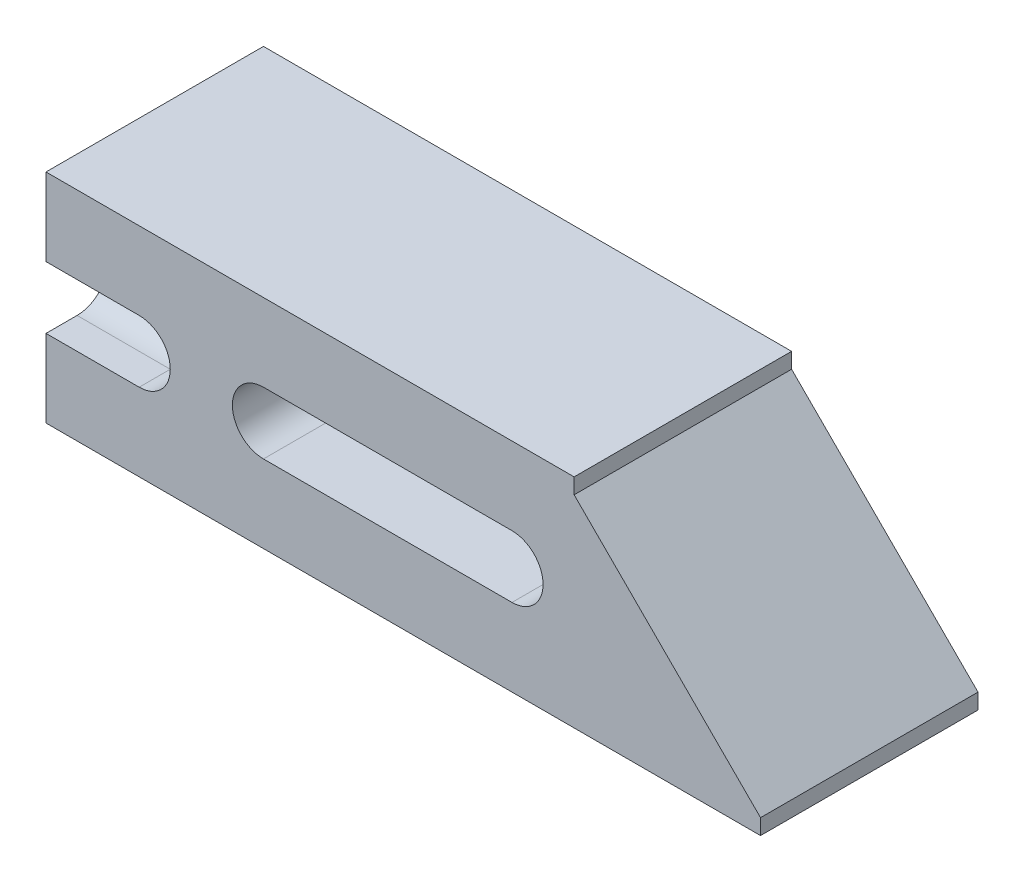
ISO-10303-21;
HEADER;
FILE_DESCRIPTION(('STEP AP214'),'2;1');
FILE_NAME('part.step','',(''),(''),'','','');
FILE_SCHEMA(('AUTOMOTIVE_DESIGN { 1 0 10303 214 1 1 1 1 }'));
ENDSEC;
DATA;
#1=APPLICATION_CONTEXT('core data for automotive mechanical design processes');
#2=APPLICATION_PROTOCOL_DEFINITION('international standard','automotive_design',2000,#1);
#3=PRODUCT_CONTEXT('',#1,'mechanical');
#4=PRODUCT('Part','Part','',(#3));
#5=PRODUCT_RELATED_PRODUCT_CATEGORY('part','',(#4));
#6=PRODUCT_DEFINITION_FORMATION('','',#4);
#7=PRODUCT_DEFINITION_CONTEXT('part definition',#1,'design');
#8=PRODUCT_DEFINITION('design','',#6,#7);
#9=PRODUCT_DEFINITION_SHAPE('','',#8);
#10=(LENGTH_UNIT() NAMED_UNIT(*) SI_UNIT(.MILLI.,.METRE.));
#11=(NAMED_UNIT(*) PLANE_ANGLE_UNIT() SI_UNIT($,.RADIAN.));
#12=(NAMED_UNIT(*) SI_UNIT($,.STERADIAN.) SOLID_ANGLE_UNIT());
#13=UNCERTAINTY_MEASURE_WITH_UNIT(LENGTH_MEASURE(1.E-05),#10,'distance_accuracy_value','');
#14=(GEOMETRIC_REPRESENTATION_CONTEXT(3) GLOBAL_UNCERTAINTY_ASSIGNED_CONTEXT((#13)) GLOBAL_UNIT_ASSIGNED_CONTEXT((#10,
#11,#12)) REPRESENTATION_CONTEXT('',''));
#15=CARTESIAN_POINT('',(0.,0.,0.));
#16=DIRECTION('',(0.,0.,1.));
#17=DIRECTION('',(1.,0.,0.));
#18=AXIS2_PLACEMENT_3D('',#15,#16,#17);
#19=CARTESIAN_POINT('',(9.525,11.1125,-6.98500000000001));
#20=DIRECTION('',(0.,0.,1.));
#21=DIRECTION('',(1.,0.,0.));
#22=AXIS2_PLACEMENT_3D('',#19,#20,#21);
#23=CYLINDRICAL_SURFACE('',#22,3.175);
#24=DIRECTION('',(0.,0.,1.));
#25=VECTOR('',#24,1.);
#26=CARTESIAN_POINT('',(9.525,7.93749999999999,-6.98500000000001));
#27=LINE('',#26,#25);
#28=CARTESIAN_POINT('',(9.525,7.9375,19.05));
#29=VERTEX_POINT('',#28);
#30=CARTESIAN_POINT('',(9.52500000000001,7.9375,22.225));
#31=VERTEX_POINT('',#30);
#32=EDGE_CURVE('E190',#29,#31,#27,.T.);
#33=ORIENTED_EDGE('',*,*,#32,.T.);
#34=CARTESIAN_POINT('',(9.525,11.1125,22.225));
#35=DIRECTION('',(0.,0.,1.));
#36=DIRECTION('',(1.,0.,0.));
#37=AXIS2_PLACEMENT_3D('',#34,#35,#36);
#38=CIRCLE('',#37,3.175);
#39=CARTESIAN_POINT('',(9.525,14.2875,22.225));
#40=VERTEX_POINT('',#39);
#41=EDGE_CURVE('E183',#31,#40,#38,.T.);
#42=ORIENTED_EDGE('',*,*,#41,.T.);
#43=DIRECTION('',(0.,0.,1.));
#44=VECTOR('',#43,1.);
#45=CARTESIAN_POINT('',(9.525,14.2875,-6.98500000000002));
#46=LINE('',#45,#44);
#47=CARTESIAN_POINT('',(9.525,14.2875,19.05));
#48=VERTEX_POINT('',#47);
#49=EDGE_CURVE('E202',#48,#40,#46,.T.);
#50=ORIENTED_EDGE('',*,*,#49,.F.);
#51=CARTESIAN_POINT('',(9.525,11.1125,19.05));
#52=DIRECTION('',(-0.707106781186547,0.,0.707106781186547));
#53=DIRECTION('',(-0.707106781186547,0.,-0.707106781186547));
#54=AXIS2_PLACEMENT_3D('',#51,#52,#53);
#55=ELLIPSE('',#54,4.49012806053458,3.175);
#56=EDGE_CURVE('E199',#29,#48,#55,.F.);
#57=ORIENTED_EDGE('',*,*,#56,.F.);
#58=EDGE_LOOP('',(#33,#42,#50,#57));
#59=FACE_BOUND('',#58,.T.);
#60=DIRECTION('',(0.,0.,1.));
#61=VECTOR('',#60,1.);
#62=CARTESIAN_POINT('',(9.525,7.9375,-6.98500000000001));
#63=LINE('',#62,#61);
#64=CARTESIAN_POINT('',(9.525,7.9375,0.));
#65=VERTEX_POINT('',#64);
#66=CARTESIAN_POINT('',(9.52500000000001,7.9375,3.175));
#67=VERTEX_POINT('',#66);
#68=EDGE_CURVE('E168',#65,#67,#63,.T.);
#69=ORIENTED_EDGE('',*,*,#68,.T.);
#70=CARTESIAN_POINT('',(9.525,11.1125,3.175));
#71=DIRECTION('',(-0.707106781186547,0.,-0.707106781186547));
#72=DIRECTION('',(-0.707106781186547,0.,0.707106781186547));
#73=AXIS2_PLACEMENT_3D('',#70,#71,#72);
#74=ELLIPSE('',#73,4.49012806053458,3.175);
#75=CARTESIAN_POINT('',(9.525,14.2875,3.175));
#76=VERTEX_POINT('',#75);
#77=EDGE_CURVE('E179',#76,#67,#74,.F.);
#78=ORIENTED_EDGE('',*,*,#77,.F.);
#79=DIRECTION('',(0.,0.,1.));
#80=VECTOR('',#79,1.);
#81=CARTESIAN_POINT('',(9.525,14.2875,-6.98500000000001));
#82=LINE('',#81,#80);
#83=CARTESIAN_POINT('',(9.525,14.2875,0.));
#84=VERTEX_POINT('',#83);
#85=EDGE_CURVE('E184',#84,#76,#82,.T.);
#86=ORIENTED_EDGE('',*,*,#85,.F.);
#87=CARTESIAN_POINT('',(9.525,11.1125,0.));
#88=DIRECTION('',(0.,0.,-1.));
#89=DIRECTION('',(-1.,0.,0.));
#90=AXIS2_PLACEMENT_3D('',#87,#88,#89);
#91=CIRCLE('',#90,3.175);
#92=EDGE_CURVE('E188',#84,#65,#91,.T.);
#93=ORIENTED_EDGE('',*,*,#92,.T.);
#94=EDGE_LOOP('',(#69,#78,#86,#93));
#95=FACE_BOUND('',#94,.T.);
#96=ADVANCED_FACE('F39',(#59,#95),#23,.F.);
#97=CARTESIAN_POINT('',(73.025,0.,22.225));
#98=DIRECTION('',(0.,1.,0.));
#99=DIRECTION('',(-1.,0.,0.));
#100=AXIS2_PLACEMENT_3D('',#97,#98,#99);
#101=PLANE('',#100);
#102=DIRECTION('',(1.,0.,0.));
#103=VECTOR('',#102,1.);
#104=CARTESIAN_POINT('',(73.025,0.,0.));
#105=LINE('',#104,#103);
#106=CARTESIAN_POINT('',(0.,0.,0.));
#107=VERTEX_POINT('',#106);
#108=CARTESIAN_POINT('',(73.025,0.,0.));
#109=VERTEX_POINT('',#108);
#110=EDGE_CURVE('E280',#107,#109,#105,.T.);
#111=ORIENTED_EDGE('',*,*,#110,.T.);
#112=DIRECTION('',(0.,0.,-1.));
#113=VECTOR('',#112,1.);
#114=CARTESIAN_POINT('',(73.025,0.,22.225));
#115=LINE('',#114,#113);
#116=CARTESIAN_POINT('',(73.025,0.,22.225));
#117=VERTEX_POINT('',#116);
#118=EDGE_CURVE('E319',#117,#109,#115,.T.);
#119=ORIENTED_EDGE('',*,*,#118,.F.);
#120=DIRECTION('',(1.,0.,0.));
#121=VECTOR('',#120,1.);
#122=CARTESIAN_POINT('',(73.025,0.,22.225));
#123=LINE('',#122,#121);
#124=CARTESIAN_POINT('',(0.,0.,22.225));
#125=VERTEX_POINT('',#124);
#126=EDGE_CURVE('E257',#125,#117,#123,.T.);
#127=ORIENTED_EDGE('',*,*,#126,.F.);
#128=DIRECTION('',(0.,0.,-1.));
#129=VECTOR('',#128,1.);
#130=CARTESIAN_POINT('',(0.,0.,22.225));
#131=LINE('',#130,#129);
#132=EDGE_CURVE('E279',#125,#107,#131,.T.);
#133=ORIENTED_EDGE('',*,*,#132,.T.);
#134=EDGE_LOOP('',(#111,#119,#127,#133));
#135=FACE_BOUND('',#134,.T.);
#136=ADVANCED_FACE('F41',(#135),#101,.F.);
#137=CARTESIAN_POINT('',(73.025,1.5875,22.225));
#138=DIRECTION('',(-1.,0.,0.));
#139=DIRECTION('',(0.,0.,1.));
#140=AXIS2_PLACEMENT_3D('',#137,#138,#139);
#141=PLANE('',#140);
#142=DIRECTION('',(0.,1.,0.));
#143=VECTOR('',#142,1.);
#144=CARTESIAN_POINT('',(73.025,1.5875,0.));
#145=LINE('',#144,#143);
#146=CARTESIAN_POINT('',(73.025,1.5875,0.));
#147=VERTEX_POINT('',#146);
#148=EDGE_CURVE('E284',#109,#147,#145,.T.);
#149=ORIENTED_EDGE('',*,*,#148,.T.);
#150=DIRECTION('',(0.,0.,-1.));
#151=VECTOR('',#150,1.);
#152=CARTESIAN_POINT('',(73.025,1.5875,22.225));
#153=LINE('',#152,#151);
#154=CARTESIAN_POINT('',(73.025,1.5875,22.225));
#155=VERTEX_POINT('',#154);
#156=EDGE_CURVE('E315',#155,#147,#153,.T.);
#157=ORIENTED_EDGE('',*,*,#156,.F.);
#158=DIRECTION('',(0.,1.,0.));
#159=VECTOR('',#158,1.);
#160=CARTESIAN_POINT('',(73.025,1.5875,22.225));
#161=LINE('',#160,#159);
#162=EDGE_CURVE('E261',#117,#155,#161,.T.);
#163=ORIENTED_EDGE('',*,*,#162,.F.);
#164=ORIENTED_EDGE('',*,*,#118,.T.);
#165=EDGE_LOOP('',(#149,#157,#163,#164));
#166=FACE_BOUND('',#165,.T.);
#167=ADVANCED_FACE('F374',(#166),#141,.F.);
#168=CARTESIAN_POINT('',(53.975,20.6374999999998,22.225));
#169=DIRECTION('',(-0.707106781186543,-0.707106781186552,0.));
#170=DIRECTION('',(0.707106781186552,-0.707106781186543,0.));
#171=AXIS2_PLACEMENT_3D('',#168,#169,#170);
#172=PLANE('',#171);
#173=DIRECTION('',(-0.707106781186552,0.707106781186543,0.));
#174=VECTOR('',#173,1.);
#175=CARTESIAN_POINT('',(53.975,20.6374999999998,0.));
#176=LINE('',#175,#174);
#177=CARTESIAN_POINT('',(53.975,20.6374999999998,0.));
#178=VERTEX_POINT('',#177);
#179=EDGE_CURVE('E287',#147,#178,#176,.T.);
#180=ORIENTED_EDGE('',*,*,#179,.T.);
#181=DIRECTION('',(0.,0.,-1.));
#182=VECTOR('',#181,1.);
#183=CARTESIAN_POINT('',(53.975,20.6374999999998,22.225));
#184=LINE('',#183,#182);
#185=CARTESIAN_POINT('',(53.975,20.6374999999998,22.225));
#186=VERTEX_POINT('',#185);
#187=EDGE_CURVE('E311',#186,#178,#184,.T.);
#188=ORIENTED_EDGE('',*,*,#187,.F.);
#189=DIRECTION('',(-0.707106781186552,0.707106781186543,0.));
#190=VECTOR('',#189,1.);
#191=CARTESIAN_POINT('',(53.975,20.6374999999998,22.225));
#192=LINE('',#191,#190);
#193=EDGE_CURVE('E265',#155,#186,#192,.T.);
#194=ORIENTED_EDGE('',*,*,#193,.F.);
#195=ORIENTED_EDGE('',*,*,#156,.T.);
#196=EDGE_LOOP('',(#180,#188,#194,#195));
#197=FACE_BOUND('',#196,.T.);
#198=ADVANCED_FACE('F393',(#197),#172,.F.);
#199=CARTESIAN_POINT('',(53.975,22.225,22.225));
#200=DIRECTION('',(-1.,0.,0.));
#201=DIRECTION('',(0.,0.,1.));
#202=AXIS2_PLACEMENT_3D('',#199,#200,#201);
#203=PLANE('',#202);
#204=DIRECTION('',(0.,1.,0.));
#205=VECTOR('',#204,1.);
#206=CARTESIAN_POINT('',(53.975,22.225,0.));
#207=LINE('',#206,#205);
#208=CARTESIAN_POINT('',(53.975,22.225,0.));
#209=VERTEX_POINT('',#208);
#210=EDGE_CURVE('E290',#178,#209,#207,.T.);
#211=ORIENTED_EDGE('',*,*,#210,.T.);
#212=DIRECTION('',(0.,0.,-1.));
#213=VECTOR('',#212,1.);
#214=CARTESIAN_POINT('',(53.975,22.225,22.225));
#215=LINE('',#214,#213);
#216=CARTESIAN_POINT('',(53.975,22.225,22.225));
#217=VERTEX_POINT('',#216);
#218=EDGE_CURVE('E307',#217,#209,#215,.T.);
#219=ORIENTED_EDGE('',*,*,#218,.F.);
#220=DIRECTION('',(0.,1.,0.));
#221=VECTOR('',#220,1.);
#222=CARTESIAN_POINT('',(53.975,22.225,22.225));
#223=LINE('',#222,#221);
#224=EDGE_CURVE('E268',#186,#217,#223,.T.);
#225=ORIENTED_EDGE('',*,*,#224,.F.);
#226=ORIENTED_EDGE('',*,*,#187,.T.);
#227=EDGE_LOOP('',(#211,#219,#225,#226));
#228=FACE_BOUND('',#227,.T.);
#229=ADVANCED_FACE('F389',(#228),#203,.F.);
#230=CARTESIAN_POINT('',(0.,22.225,22.225));
#231=DIRECTION('',(0.,-1.,0.));
#232=DIRECTION('',(0.,0.,-1.));
#233=AXIS2_PLACEMENT_3D('',#230,#231,#232);
#234=PLANE('',#233);
#235=DIRECTION('',(-1.,0.,0.));
#236=VECTOR('',#235,1.);
#237=CARTESIAN_POINT('',(0.,22.225,0.));
#238=LINE('',#237,#236);
#239=CARTESIAN_POINT('',(0.,22.225,0.));
#240=VERTEX_POINT('',#239);
#241=EDGE_CURVE('E293',#209,#240,#238,.T.);
#242=ORIENTED_EDGE('',*,*,#241,.T.);
#243=DIRECTION('',(0.,0.,-1.));
#244=VECTOR('',#243,1.);
#245=CARTESIAN_POINT('',(0.,22.225,22.225));
#246=LINE('',#245,#244);
#247=CARTESIAN_POINT('',(0.,22.225,22.225));
#248=VERTEX_POINT('',#247);
#249=EDGE_CURVE('E303',#248,#240,#246,.T.);
#250=ORIENTED_EDGE('',*,*,#249,.F.);
#251=DIRECTION('',(-1.,0.,0.));
#252=VECTOR('',#251,1.);
#253=CARTESIAN_POINT('',(0.,22.225,22.225));
#254=LINE('',#253,#252);
#255=EDGE_CURVE('E271',#217,#248,#254,.T.);
#256=ORIENTED_EDGE('',*,*,#255,.F.);
#257=ORIENTED_EDGE('',*,*,#218,.T.);
#258=EDGE_LOOP('',(#242,#250,#256,#257));
#259=FACE_BOUND('',#258,.T.);
#260=ADVANCED_FACE('F385',(#259),#234,.F.);
#261=CARTESIAN_POINT('',(0.,0.,22.225));
#262=DIRECTION('',(1.,0.,0.));
#263=DIRECTION('',(0.,0.,-1.));
#264=AXIS2_PLACEMENT_3D('',#261,#262,#263);
#265=PLANE('',#264);
#266=CARTESIAN_POINT('',(0.,11.1125,3.175));
#267=DIRECTION('',(-1.,0.,0.));
#268=DIRECTION('',(0.,0.,1.));
#269=AXIS2_PLACEMENT_3D('',#266,#267,#268);
#270=CIRCLE('',#269,3.175);
#271=CARTESIAN_POINT('',(0.,7.9375,3.175));
#272=VERTEX_POINT('',#271);
#273=CARTESIAN_POINT('',(0.,14.2875,3.175));
#274=VERTEX_POINT('',#273);
#275=EDGE_CURVE('E429',#272,#274,#270,.T.);
#276=ORIENTED_EDGE('',*,*,#275,.F.);
#277=DIRECTION('',(0.,0.,1.));
#278=VECTOR('',#277,1.);
#279=CARTESIAN_POINT('',(0.,7.9375,0.));
#280=LINE('',#279,#278);
#281=CARTESIAN_POINT('',(0.,7.9375,0.));
#282=VERTEX_POINT('',#281);
#283=EDGE_CURVE('E171',#282,#272,#280,.T.);
#284=ORIENTED_EDGE('',*,*,#283,.F.);
#285=DIRECTION('',(0.,-1.,0.));
#286=VECTOR('',#285,1.);
#287=CARTESIAN_POINT('',(0.,0.,0.));
#288=LINE('',#287,#286);
#289=EDGE_CURVE('E296',#282,#107,#288,.T.);
#290=ORIENTED_EDGE('',*,*,#289,.T.);
#291=ORIENTED_EDGE('',*,*,#132,.F.);
#292=DIRECTION('',(0.,-1.,0.));
#293=VECTOR('',#292,1.);
#294=CARTESIAN_POINT('',(0.,0.,22.225));
#295=LINE('',#294,#293);
#296=CARTESIAN_POINT('',(0.,7.9375,22.225));
#297=VERTEX_POINT('',#296);
#298=EDGE_CURVE('E274',#297,#125,#295,.T.);
#299=ORIENTED_EDGE('',*,*,#298,.F.);
#300=DIRECTION('',(0.,0.,1.));
#301=VECTOR('',#300,1.);
#302=CARTESIAN_POINT('',(0.,7.9375,19.05));
#303=LINE('',#302,#301);
#304=CARTESIAN_POINT('',(0.,7.9375,19.05));
#305=VERTEX_POINT('',#304);
#306=EDGE_CURVE('E208',#305,#297,#303,.T.);
#307=ORIENTED_EDGE('',*,*,#306,.F.);
#308=CARTESIAN_POINT('',(0.,11.1125,19.05));
#309=DIRECTION('',(-1.,0.,0.));
#310=DIRECTION('',(0.,0.,1.));
#311=AXIS2_PLACEMENT_3D('',#308,#309,#310);
#312=CIRCLE('',#311,3.175);
#313=CARTESIAN_POINT('',(0.,14.2875,19.05));
#314=VERTEX_POINT('',#313);
#315=EDGE_CURVE('E205',#314,#305,#312,.T.);
#316=ORIENTED_EDGE('',*,*,#315,.F.);
#317=DIRECTION('',(0.,0.,-1.));
#318=VECTOR('',#317,1.);
#319=CARTESIAN_POINT('',(0.,14.2875,22.225));
#320=LINE('',#319,#318);
#321=CARTESIAN_POINT('',(0.,14.2875,22.225));
#322=VERTEX_POINT('',#321);
#323=EDGE_CURVE('E211',#322,#314,#320,.T.);
#324=ORIENTED_EDGE('',*,*,#323,.F.);
#325=EDGE_CURVE('E275',#248,#322,#295,.T.);
#326=ORIENTED_EDGE('',*,*,#325,.F.);
#327=ORIENTED_EDGE('',*,*,#249,.T.);
#328=CARTESIAN_POINT('',(0.,14.2875,0.));
#329=VERTEX_POINT('',#328);
#330=EDGE_CURVE('E262',#240,#329,#288,.T.);
#331=ORIENTED_EDGE('',*,*,#330,.T.);
#332=DIRECTION('',(0.,0.,-1.));
#333=VECTOR('',#332,1.);
#334=CARTESIAN_POINT('',(0.,14.2875,3.175));
#335=LINE('',#334,#333);
#336=EDGE_CURVE('E426',#274,#329,#335,.T.);
#337=ORIENTED_EDGE('',*,*,#336,.F.);
#338=EDGE_LOOP('',(#276,#284,#290,#291,#299,#307,#316,#324,#326,#327,#331,#337));
#339=FACE_BOUND('',#338,.T.);
#340=ADVANCED_FACE('F379',(#339),#265,.F.);
#341=CARTESIAN_POINT('',(0.,0.,22.225));
#342=DIRECTION('',(0.,0.,-1.));
#343=DIRECTION('',(-1.,0.,0.));
#344=AXIS2_PLACEMENT_3D('',#341,#342,#343);
#345=PLANE('',#344);
#346=DIRECTION('',(-1.,0.,0.));
#347=VECTOR('',#346,1.);
#348=CARTESIAN_POINT('',(47.625,7.9375,22.225));
#349=LINE('',#348,#347);
#350=CARTESIAN_POINT('',(47.625,7.9375,22.225));
#351=VERTEX_POINT('',#350);
#352=CARTESIAN_POINT('',(22.225,7.9375,22.225));
#353=VERTEX_POINT('',#352);
#354=EDGE_CURVE('E229',#351,#353,#349,.T.);
#355=ORIENTED_EDGE('',*,*,#354,.T.);
#356=CARTESIAN_POINT('',(22.225,11.1125,22.225));
#357=DIRECTION('',(0.,0.,1.));
#358=DIRECTION('',(1.,0.,0.));
#359=AXIS2_PLACEMENT_3D('',#356,#357,#358);
#360=CIRCLE('',#359,3.175);
#361=CARTESIAN_POINT('',(22.225,14.2875,22.225));
#362=VERTEX_POINT('',#361);
#363=EDGE_CURVE('E226',#362,#353,#360,.T.);
#364=ORIENTED_EDGE('',*,*,#363,.F.);
#365=DIRECTION('',(1.,0.,0.));
#366=VECTOR('',#365,1.);
#367=CARTESIAN_POINT('',(22.225,14.2875,22.225));
#368=LINE('',#367,#366);
#369=CARTESIAN_POINT('',(47.625,14.2875,22.225));
#370=VERTEX_POINT('',#369);
#371=EDGE_CURVE('E237',#362,#370,#368,.T.);
#372=ORIENTED_EDGE('',*,*,#371,.T.);
#373=CARTESIAN_POINT('',(47.625,11.1125,22.225));
#374=DIRECTION('',(0.,0.,1.));
#375=DIRECTION('',(1.,0.,0.));
#376=AXIS2_PLACEMENT_3D('',#373,#374,#375);
#377=CIRCLE('',#376,3.175);
#378=EDGE_CURVE('E233',#351,#370,#377,.T.);
#379=ORIENTED_EDGE('',*,*,#378,.F.);
#380=EDGE_LOOP('',(#355,#364,#372,#379));
#381=FACE_BOUND('',#380,.T.);
#382=ORIENTED_EDGE('',*,*,#41,.F.);
#383=DIRECTION('',(-1.,0.,0.));
#384=VECTOR('',#383,1.);
#385=CARTESIAN_POINT('',(73.026,7.9375,22.225));
#386=LINE('',#385,#384);
#387=EDGE_CURVE('E220',#31,#297,#386,.T.);
#388=ORIENTED_EDGE('',*,*,#387,.T.);
#389=ORIENTED_EDGE('',*,*,#298,.T.);
#390=ORIENTED_EDGE('',*,*,#126,.T.);
#391=ORIENTED_EDGE('',*,*,#162,.T.);
#392=ORIENTED_EDGE('',*,*,#193,.T.);
#393=ORIENTED_EDGE('',*,*,#224,.T.);
#394=ORIENTED_EDGE('',*,*,#255,.T.);
#395=ORIENTED_EDGE('',*,*,#325,.T.);
#396=DIRECTION('',(-1.,0.,0.));
#397=VECTOR('',#396,1.);
#398=CARTESIAN_POINT('',(73.026,14.2875,22.225));
#399=LINE('',#398,#397);
#400=EDGE_CURVE('E217',#40,#322,#399,.T.);
#401=ORIENTED_EDGE('',*,*,#400,.F.);
#402=EDGE_LOOP('',(#382,#388,#389,#390,#391,#392,#393,#394,#395,#401));
#403=FACE_BOUND('',#402,.T.);
#404=ADVANCED_FACE('F349',(#381,#403),#345,.F.);
#405=CARTESIAN_POINT('',(0.,0.,0.));
#406=DIRECTION('',(0.,0.,-1.));
#407=DIRECTION('',(-1.,0.,0.));
#408=AXIS2_PLACEMENT_3D('',#405,#406,#407);
#409=PLANE('',#408);
#410=DIRECTION('',(-1.,0.,0.));
#411=VECTOR('',#410,1.);
#412=CARTESIAN_POINT('',(73.026,7.9375,0.));
#413=LINE('',#412,#411);
#414=EDGE_CURVE('E421',#65,#282,#413,.T.);
#415=ORIENTED_EDGE('',*,*,#414,.F.);
#416=ORIENTED_EDGE('',*,*,#92,.F.);
#417=DIRECTION('',(-1.,0.,0.));
#418=VECTOR('',#417,1.);
#419=CARTESIAN_POINT('',(73.026,14.2875,0.));
#420=LINE('',#419,#418);
#421=EDGE_CURVE('E63',#84,#329,#420,.T.);
#422=ORIENTED_EDGE('',*,*,#421,.T.);
#423=ORIENTED_EDGE('',*,*,#330,.F.);
#424=ORIENTED_EDGE('',*,*,#241,.F.);
#425=ORIENTED_EDGE('',*,*,#210,.F.);
#426=ORIENTED_EDGE('',*,*,#179,.F.);
#427=ORIENTED_EDGE('',*,*,#148,.F.);
#428=ORIENTED_EDGE('',*,*,#110,.F.);
#429=ORIENTED_EDGE('',*,*,#289,.F.);
#430=EDGE_LOOP('',(#415,#416,#422,#423,#424,#425,#426,#427,#428,#429));
#431=FACE_BOUND('',#430,.T.);
#432=CARTESIAN_POINT('',(22.225,11.1125,0.));
#433=DIRECTION('',(0.,0.,-1.));
#434=DIRECTION('',(-1.,0.,0.));
#435=AXIS2_PLACEMENT_3D('',#432,#433,#434);
#436=CIRCLE('',#435,3.175);
#437=CARTESIAN_POINT('',(22.225,7.9375,0.));
#438=VERTEX_POINT('',#437);
#439=CARTESIAN_POINT('',(22.225,14.2875,0.));
#440=VERTEX_POINT('',#439);
#441=EDGE_CURVE('E11',#438,#440,#436,.T.);
#442=ORIENTED_EDGE('',*,*,#441,.F.);
#443=DIRECTION('',(1.,0.,0.));
#444=VECTOR('',#443,1.);
#445=CARTESIAN_POINT('',(0.,7.9375,0.));
#446=LINE('',#445,#444);
#447=CARTESIAN_POINT('',(47.625,7.9375,0.));
#448=VERTEX_POINT('',#447);
#449=EDGE_CURVE('E323',#438,#448,#446,.T.);
#450=ORIENTED_EDGE('',*,*,#449,.T.);
#451=CARTESIAN_POINT('',(47.625,11.1125,0.));
#452=DIRECTION('',(0.,0.,-1.));
#453=DIRECTION('',(-1.,0.,0.));
#454=AXIS2_PLACEMENT_3D('',#451,#452,#453);
#455=CIRCLE('',#454,3.175);
#456=CARTESIAN_POINT('',(47.625,14.2875,0.));
#457=VERTEX_POINT('',#456);
#458=EDGE_CURVE('E329',#457,#448,#455,.T.);
#459=ORIENTED_EDGE('',*,*,#458,.F.);
#460=DIRECTION('',(-1.,0.,0.));
#461=VECTOR('',#460,1.);
#462=CARTESIAN_POINT('',(0.,14.2875,0.));
#463=LINE('',#462,#461);
#464=EDGE_CURVE('E48',#457,#440,#463,.T.);
#465=ORIENTED_EDGE('',*,*,#464,.T.);
#466=EDGE_LOOP('',(#442,#450,#459,#465));
#467=FACE_BOUND('',#466,.T.);
#468=ADVANCED_FACE('F337',(#431,#467),#409,.T.);
#469=CARTESIAN_POINT('',(22.225,11.1125,-6.98500000000001));
#470=DIRECTION('',(0.,0.,1.));
#471=DIRECTION('',(1.,0.,0.));
#472=AXIS2_PLACEMENT_3D('',#469,#470,#471);
#473=CYLINDRICAL_SURFACE('',#472,3.175);
#474=ORIENTED_EDGE('',*,*,#441,.T.);
#475=DIRECTION('',(0.,0.,1.));
#476=VECTOR('',#475,1.);
#477=CARTESIAN_POINT('',(22.225,14.2875,-6.98500000000001));
#478=LINE('',#477,#476);
#479=EDGE_CURVE('E242',#440,#362,#478,.T.);
#480=ORIENTED_EDGE('',*,*,#479,.T.);
#481=ORIENTED_EDGE('',*,*,#363,.T.);
#482=DIRECTION('',(0.,0.,1.));
#483=VECTOR('',#482,1.);
#484=CARTESIAN_POINT('',(22.225,7.9375,-6.98500000000001));
#485=LINE('',#484,#483);
#486=EDGE_CURVE('E241',#438,#353,#485,.T.);
#487=ORIENTED_EDGE('',*,*,#486,.F.);
#488=EDGE_LOOP('',(#474,#480,#481,#487));
#489=FACE_BOUND('',#488,.T.);
#490=ADVANCED_FACE('F353',(#489),#473,.F.);
#491=CARTESIAN_POINT('',(22.225,14.2875,-6.98500000000001));
#492=DIRECTION('',(0.,-1.,0.));
#493=DIRECTION('',(0.,0.,-1.));
#494=AXIS2_PLACEMENT_3D('',#491,#492,#493);
#495=PLANE('',#494);
#496=DIRECTION('',(0.,0.,1.));
#497=VECTOR('',#496,1.);
#498=CARTESIAN_POINT('',(47.625,14.2875,-6.98500000000001));
#499=LINE('',#498,#497);
#500=EDGE_CURVE('E245',#457,#370,#499,.T.);
#501=ORIENTED_EDGE('',*,*,#500,.T.);
#502=ORIENTED_EDGE('',*,*,#371,.F.);
#503=ORIENTED_EDGE('',*,*,#479,.F.);
#504=ORIENTED_EDGE('',*,*,#464,.F.);
#505=EDGE_LOOP('',(#501,#502,#503,#504));
#506=FACE_BOUND('',#505,.T.);
#507=ADVANCED_FACE('F341',(#506),#495,.T.);
#508=CARTESIAN_POINT('',(47.625,11.1125,-6.98500000000001));
#509=DIRECTION('',(0.,0.,1.));
#510=DIRECTION('',(1.,0.,0.));
#511=AXIS2_PLACEMENT_3D('',#508,#509,#510);
#512=CYLINDRICAL_SURFACE('',#511,3.175);
#513=ORIENTED_EDGE('',*,*,#458,.T.);
#514=DIRECTION('',(0.,0.,1.));
#515=VECTOR('',#514,1.);
#516=CARTESIAN_POINT('',(47.625,7.9375,-6.98500000000001));
#517=LINE('',#516,#515);
#518=EDGE_CURVE('E248',#448,#351,#517,.T.);
#519=ORIENTED_EDGE('',*,*,#518,.T.);
#520=ORIENTED_EDGE('',*,*,#378,.T.);
#521=ORIENTED_EDGE('',*,*,#500,.F.);
#522=EDGE_LOOP('',(#513,#519,#520,#521));
#523=FACE_BOUND('',#522,.T.);
#524=ADVANCED_FACE('F344',(#523),#512,.F.);
#525=CARTESIAN_POINT('',(47.625,7.9375,-6.98500000000001));
#526=DIRECTION('',(0.,1.,0.));
#527=DIRECTION('',(0.,0.,1.));
#528=AXIS2_PLACEMENT_3D('',#525,#526,#527);
#529=PLANE('',#528);
#530=ORIENTED_EDGE('',*,*,#486,.T.);
#531=ORIENTED_EDGE('',*,*,#354,.F.);
#532=ORIENTED_EDGE('',*,*,#518,.F.);
#533=ORIENTED_EDGE('',*,*,#449,.F.);
#534=EDGE_LOOP('',(#530,#531,#532,#533));
#535=FACE_BOUND('',#534,.T.);
#536=ADVANCED_FACE('F355',(#535),#529,.T.);
#537=CARTESIAN_POINT('',(73.026,7.9375,19.05));
#538=DIRECTION('',(0.,-1.,0.));
#539=DIRECTION('',(0.,0.,-1.));
#540=AXIS2_PLACEMENT_3D('',#537,#538,#539);
#541=PLANE('',#540);
#542=DIRECTION('',(-1.,0.,0.));
#543=VECTOR('',#542,1.);
#544=CARTESIAN_POINT('',(73.026,7.9375,19.05));
#545=LINE('',#544,#543);
#546=EDGE_CURVE('E55',#29,#305,#545,.T.);
#547=ORIENTED_EDGE('',*,*,#546,.T.);
#548=ORIENTED_EDGE('',*,*,#306,.T.);
#549=ORIENTED_EDGE('',*,*,#387,.F.);
#550=ORIENTED_EDGE('',*,*,#32,.F.);
#551=EDGE_LOOP('',(#547,#548,#549,#550));
#552=FACE_BOUND('',#551,.T.);
#553=ADVANCED_FACE('F357',(#552),#541,.F.);
#554=CARTESIAN_POINT('',(73.026,14.2875,22.225));
#555=DIRECTION('',(0.,1.,0.));
#556=DIRECTION('',(0.,0.,1.));
#557=AXIS2_PLACEMENT_3D('',#554,#555,#556);
#558=PLANE('',#557);
#559=ORIENTED_EDGE('',*,*,#49,.T.);
#560=ORIENTED_EDGE('',*,*,#400,.T.);
#561=ORIENTED_EDGE('',*,*,#323,.T.);
#562=DIRECTION('',(-1.,0.,0.));
#563=VECTOR('',#562,1.);
#564=CARTESIAN_POINT('',(73.026,14.2875,19.05));
#565=LINE('',#564,#563);
#566=EDGE_CURVE('E194',#48,#314,#565,.T.);
#567=ORIENTED_EDGE('',*,*,#566,.F.);
#568=EDGE_LOOP('',(#559,#560,#561,#567));
#569=FACE_BOUND('',#568,.T.);
#570=ADVANCED_FACE('F363',(#569),#558,.F.);
#571=CARTESIAN_POINT('',(73.026,11.1125,19.05));
#572=DIRECTION('',(-1.,0.,0.));
#573=DIRECTION('',(0.,0.,1.));
#574=AXIS2_PLACEMENT_3D('',#571,#572,#573);
#575=CYLINDRICAL_SURFACE('',#574,3.175);
#576=ORIENTED_EDGE('',*,*,#56,.T.);
#577=ORIENTED_EDGE('',*,*,#566,.T.);
#578=ORIENTED_EDGE('',*,*,#315,.T.);
#579=ORIENTED_EDGE('',*,*,#546,.F.);
#580=EDGE_LOOP('',(#576,#577,#578,#579));
#581=FACE_BOUND('',#580,.T.);
#582=ADVANCED_FACE('F447',(#581),#575,.F.);
#583=CARTESIAN_POINT('',(73.026,7.9375,0.));
#584=DIRECTION('',(0.,-1.,0.));
#585=DIRECTION('',(0.,0.,-1.));
#586=AXIS2_PLACEMENT_3D('',#583,#584,#585);
#587=PLANE('',#586);
#588=ORIENTED_EDGE('',*,*,#414,.T.);
#589=ORIENTED_EDGE('',*,*,#283,.T.);
#590=DIRECTION('',(-1.,0.,0.));
#591=VECTOR('',#590,1.);
#592=CARTESIAN_POINT('',(73.026,7.9375,3.175));
#593=LINE('',#592,#591);
#594=EDGE_CURVE('E164',#67,#272,#593,.T.);
#595=ORIENTED_EDGE('',*,*,#594,.F.);
#596=ORIENTED_EDGE('',*,*,#68,.F.);
#597=EDGE_LOOP('',(#588,#589,#595,#596));
#598=FACE_BOUND('',#597,.T.);
#599=ADVANCED_FACE('F166',(#598),#587,.F.);
#600=CARTESIAN_POINT('',(73.026,11.1125,3.175));
#601=DIRECTION('',(-1.,0.,0.));
#602=DIRECTION('',(0.,0.,1.));
#603=AXIS2_PLACEMENT_3D('',#600,#601,#602);
#604=CYLINDRICAL_SURFACE('',#603,3.175);
#605=ORIENTED_EDGE('',*,*,#77,.T.);
#606=ORIENTED_EDGE('',*,*,#594,.T.);
#607=ORIENTED_EDGE('',*,*,#275,.T.);
#608=DIRECTION('',(-1.,0.,0.));
#609=VECTOR('',#608,1.);
#610=CARTESIAN_POINT('',(73.026,14.2875,3.175));
#611=LINE('',#610,#609);
#612=EDGE_CURVE('E176',#76,#274,#611,.T.);
#613=ORIENTED_EDGE('',*,*,#612,.F.);
#614=EDGE_LOOP('',(#605,#606,#607,#613));
#615=FACE_BOUND('',#614,.T.);
#616=ADVANCED_FACE('F180',(#615),#604,.F.);
#617=CARTESIAN_POINT('',(73.026,14.2875,3.175));
#618=DIRECTION('',(0.,1.,0.));
#619=DIRECTION('',(0.,0.,1.));
#620=AXIS2_PLACEMENT_3D('',#617,#618,#619);
#621=PLANE('',#620);
#622=ORIENTED_EDGE('',*,*,#85,.T.);
#623=ORIENTED_EDGE('',*,*,#612,.T.);
#624=ORIENTED_EDGE('',*,*,#336,.T.);
#625=ORIENTED_EDGE('',*,*,#421,.F.);
#626=EDGE_LOOP('',(#622,#623,#624,#625));
#627=FACE_BOUND('',#626,.T.);
#628=ADVANCED_FACE('F437',(#627),#621,.F.);
#629=CLOSED_SHELL('',(#96,#136,#167,#198,#229,#260,#340,#404,#468,#490,#507,#524,#536,#553,#570,
#582,#599,#616,#628));
#630=MANIFOLD_SOLID_BREP('B2',#629);
#631=ADVANCED_BREP_SHAPE_REPRESENTATION('',(#18,#630),#14);
#632=SHAPE_DEFINITION_REPRESENTATION(#9,#631);
ENDSEC;
END-ISO-10303-21;
